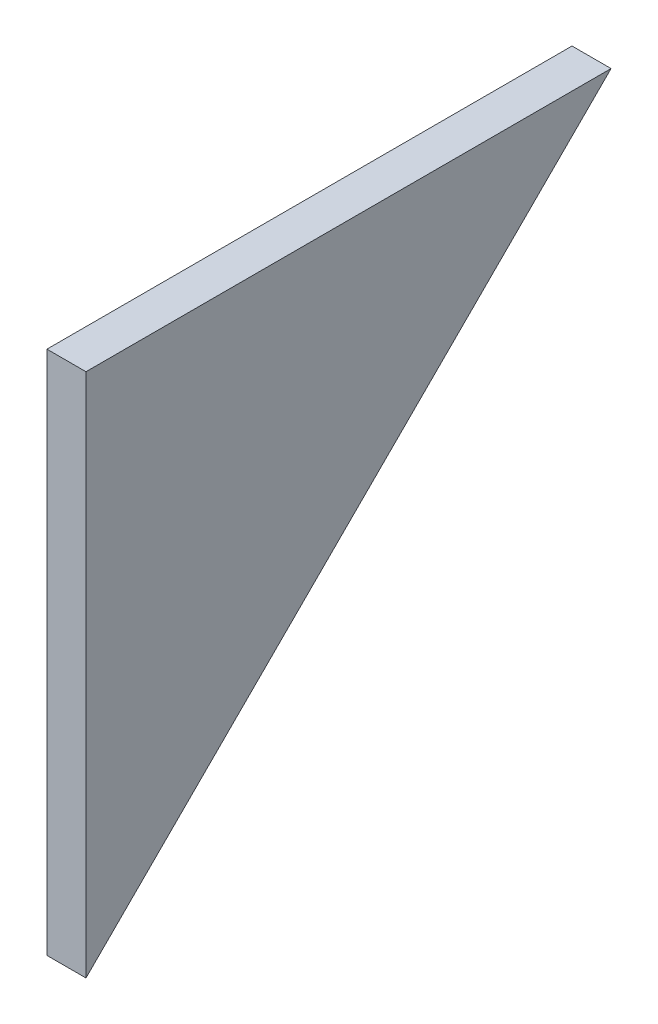
ISO-10303-21;
HEADER;
FILE_DESCRIPTION(('STEP AP214'),'2;1');
FILE_NAME('part.step','',(''),(''),'','','');
FILE_SCHEMA(('AUTOMOTIVE_DESIGN { 1 0 10303 214 1 1 1 1 }'));
ENDSEC;
DATA;
#1=APPLICATION_CONTEXT('core data for automotive mechanical design processes');
#2=APPLICATION_PROTOCOL_DEFINITION('international standard','automotive_design',2000,#1);
#3=PRODUCT_CONTEXT('',#1,'mechanical');
#4=PRODUCT('Part','Part','',(#3));
#5=PRODUCT_RELATED_PRODUCT_CATEGORY('part','',(#4));
#6=PRODUCT_DEFINITION_FORMATION('','',#4);
#7=PRODUCT_DEFINITION_CONTEXT('part definition',#1,'design');
#8=PRODUCT_DEFINITION('design','',#6,#7);
#9=PRODUCT_DEFINITION_SHAPE('','',#8);
#10=(LENGTH_UNIT() NAMED_UNIT(*) SI_UNIT(.MILLI.,.METRE.));
#11=(NAMED_UNIT(*) PLANE_ANGLE_UNIT() SI_UNIT($,.RADIAN.));
#12=(NAMED_UNIT(*) SI_UNIT($,.STERADIAN.) SOLID_ANGLE_UNIT());
#13=UNCERTAINTY_MEASURE_WITH_UNIT(LENGTH_MEASURE(1.E-05),#10,'distance_accuracy_value','');
#14=(GEOMETRIC_REPRESENTATION_CONTEXT(3) GLOBAL_UNCERTAINTY_ASSIGNED_CONTEXT((#13)) GLOBAL_UNIT_ASSIGNED_CONTEXT((#10,
#11,#12)) REPRESENTATION_CONTEXT('',''));
#15=CARTESIAN_POINT('',(0.,0.,0.));
#16=DIRECTION('',(0.,0.,1.));
#17=DIRECTION('',(1.,0.,0.));
#18=AXIS2_PLACEMENT_3D('',#15,#16,#17);
#19=CARTESIAN_POINT('',(-2.,0.,-53.7738106804815));
#20=DIRECTION('',(0.,1.,0.));
#21=DIRECTION('',(0.,0.,0.999999999999999));
#22=AXIS2_PLACEMENT_3D('',#19,#20,#21);
#23=PLANE('',#22);
#24=DIRECTION('',(-1.,0.,0.));
#25=VECTOR('',#24,1.);
#26=CARTESIAN_POINT('',(-2.,-2.46563186534487E-13,0.));
#27=LINE('',#26,#25);
#28=CARTESIAN_POINT('',(2.,-2.45230918904938E-13,0.));
#29=VERTEX_POINT('',#28);
#30=CARTESIAN_POINT('',(-2.,-2.46563186534487E-13,0.));
#31=VERTEX_POINT('',#30);
#32=EDGE_CURVE('E11',#29,#31,#27,.T.);
#33=ORIENTED_EDGE('',*,*,#32,.F.);
#34=DIRECTION('',(0.,0.,-0.999999999999999));
#35=VECTOR('',#34,1.);
#36=CARTESIAN_POINT('',(2.,0.,0.));
#37=LINE('',#36,#35);
#38=CARTESIAN_POINT('',(2.,0.,-53.7738106804814));
#39=VERTEX_POINT('',#38);
#40=EDGE_CURVE('E80',#39,#29,#37,.F.);
#41=ORIENTED_EDGE('',*,*,#40,.F.);
#42=DIRECTION('',(-1.,0.,0.));
#43=VECTOR('',#42,1.);
#44=CARTESIAN_POINT('',(-2.,0.,-53.7738106804815));
#45=LINE('',#44,#43);
#46=CARTESIAN_POINT('',(-2.,0.,-53.7738106804815));
#47=VERTEX_POINT('',#46);
#48=EDGE_CURVE('E46',#39,#47,#45,.T.);
#49=ORIENTED_EDGE('',*,*,#48,.T.);
#50=DIRECTION('',(0.,0.,0.999999999999999));
#51=VECTOR('',#50,1.);
#52=CARTESIAN_POINT('',(-2.,0.,-53.7738106804815));
#53=LINE('',#52,#51);
#54=EDGE_CURVE('E75',#47,#31,#53,.T.);
#55=ORIENTED_EDGE('',*,*,#54,.T.);
#56=EDGE_LOOP('',(#33,#41,#49,#55));
#57=FACE_BOUND('',#56,.T.);
#58=ADVANCED_FACE('F36',(#57),#23,.T.);
#59=CARTESIAN_POINT('',(-2.,-53.7738106804823,2.22044604925031E-13));
#60=DIRECTION('',(0.,-0.707106781186544,-0.70710678118655));
#61=DIRECTION('',(0.,0.707106781186551,-0.707106781186543));
#62=AXIS2_PLACEMENT_3D('',#59,#60,#61);
#63=PLANE('',#62);
#64=ORIENTED_EDGE('',*,*,#48,.F.);
#65=DIRECTION('',(0.,0.707106781186551,-0.707106781186543));
#66=VECTOR('',#65,1.);
#67=CARTESIAN_POINT('',(2.,-53.7738106804823,2.22044604925031E-13));
#68=LINE('',#67,#66);
#69=CARTESIAN_POINT('',(2.,-53.7738106804823,2.22044604925031E-13));
#70=VERTEX_POINT('',#69);
#71=EDGE_CURVE('E79',#70,#39,#68,.T.);
#72=ORIENTED_EDGE('',*,*,#71,.F.);
#73=DIRECTION('',(-1.,0.,0.));
#74=VECTOR('',#73,1.);
#75=CARTESIAN_POINT('',(-2.,-53.7738106804823,2.22044604925031E-13));
#76=LINE('',#75,#74);
#77=CARTESIAN_POINT('',(-2.,-53.7738106804823,2.22044604925031E-13));
#78=VERTEX_POINT('',#77);
#79=EDGE_CURVE('E40',#70,#78,#76,.T.);
#80=ORIENTED_EDGE('',*,*,#79,.T.);
#81=DIRECTION('',(0.,0.707106781186551,-0.707106781186543));
#82=VECTOR('',#81,1.);
#83=CARTESIAN_POINT('',(-2.,-53.7738106804823,2.22044604925031E-13));
#84=LINE('',#83,#82);
#85=EDGE_CURVE('E87',#78,#47,#84,.T.);
#86=ORIENTED_EDGE('',*,*,#85,.T.);
#87=EDGE_LOOP('',(#64,#72,#80,#86));
#88=FACE_BOUND('',#87,.T.);
#89=ADVANCED_FACE('F82',(#88),#63,.T.);
#90=CARTESIAN_POINT('',(-2.,-2.46563186534487E-13,0.));
#91=DIRECTION('',(0.,0.,0.999999999999999));
#92=DIRECTION('',(0.,-1.,0.));
#93=AXIS2_PLACEMENT_3D('',#90,#91,#92);
#94=PLANE('',#93);
#95=DIRECTION('',(0.,1.,0.));
#96=VECTOR('',#95,1.);
#97=CARTESIAN_POINT('',(2.,0.,0.));
#98=LINE('',#97,#96);
#99=EDGE_CURVE('E68',#29,#70,#98,.F.);
#100=ORIENTED_EDGE('',*,*,#99,.F.);
#101=ORIENTED_EDGE('',*,*,#32,.T.);
#102=DIRECTION('',(0.,-1.,0.));
#103=VECTOR('',#102,1.);
#104=CARTESIAN_POINT('',(-2.,-2.46563186534487E-13,0.));
#105=LINE('',#104,#103);
#106=EDGE_CURVE('E71',#31,#78,#105,.T.);
#107=ORIENTED_EDGE('',*,*,#106,.T.);
#108=ORIENTED_EDGE('',*,*,#79,.F.);
#109=EDGE_LOOP('',(#100,#101,#107,#108));
#110=FACE_BOUND('',#109,.T.);
#111=ADVANCED_FACE('F38',(#110),#94,.T.);
#112=CARTESIAN_POINT('',(-2.,0.,0.));
#113=DIRECTION('',(1.,0.,0.));
#114=DIRECTION('',(0.,0.,-0.999999999999999));
#115=AXIS2_PLACEMENT_3D('',#112,#113,#114);
#116=PLANE('',#115);
#117=ORIENTED_EDGE('',*,*,#85,.F.);
#118=ORIENTED_EDGE('',*,*,#106,.F.);
#119=ORIENTED_EDGE('',*,*,#54,.F.);
#120=EDGE_LOOP('',(#117,#118,#119));
#121=FACE_BOUND('',#120,.T.);
#122=ADVANCED_FACE('F92',(#121),#116,.F.);
#123=CARTESIAN_POINT('',(2.,0.,0.));
#124=DIRECTION('',(1.,0.,0.));
#125=DIRECTION('',(0.,0.,-0.999999999999999));
#126=AXIS2_PLACEMENT_3D('',#123,#124,#125);
#127=PLANE('',#126);
#128=ORIENTED_EDGE('',*,*,#71,.T.);
#129=ORIENTED_EDGE('',*,*,#40,.T.);
#130=ORIENTED_EDGE('',*,*,#99,.T.);
#131=EDGE_LOOP('',(#128,#129,#130));
#132=FACE_BOUND('',#131,.T.);
#133=ADVANCED_FACE('F78',(#132),#127,.T.);
#134=CLOSED_SHELL('',(#58,#89,#111,#122,#133));
#135=MANIFOLD_SOLID_BREP('B2',#134);
#136=ADVANCED_BREP_SHAPE_REPRESENTATION('',(#18,#135),#14);
#137=SHAPE_DEFINITION_REPRESENTATION(#9,#136);
ENDSEC;
END-ISO-10303-21;
